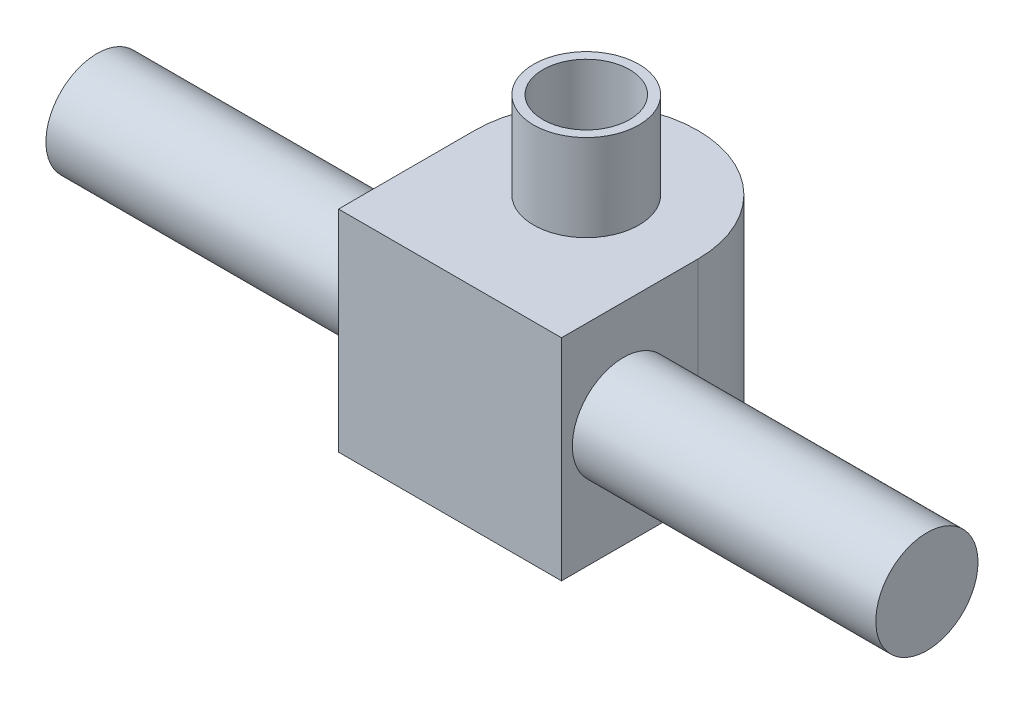
ISO-10303-21;
HEADER;
FILE_DESCRIPTION(('STEP AP214'),'2;1');
FILE_NAME('part.step','',(''),(''),'','','');
FILE_SCHEMA(('AUTOMOTIVE_DESIGN { 1 0 10303 214 1 1 1 1 }'));
ENDSEC;
DATA;
#1=APPLICATION_CONTEXT('core data for automotive mechanical design processes');
#2=APPLICATION_PROTOCOL_DEFINITION('international standard','automotive_design',2000,#1);
#3=PRODUCT_CONTEXT('',#1,'mechanical');
#4=PRODUCT('Part','Part','',(#3));
#5=PRODUCT_RELATED_PRODUCT_CATEGORY('part','',(#4));
#6=PRODUCT_DEFINITION_FORMATION('','',#4);
#7=PRODUCT_DEFINITION_CONTEXT('part definition',#1,'design');
#8=PRODUCT_DEFINITION('design','',#6,#7);
#9=PRODUCT_DEFINITION_SHAPE('','',#8);
#10=(LENGTH_UNIT() NAMED_UNIT(*) SI_UNIT(.MILLI.,.METRE.));
#11=(NAMED_UNIT(*) PLANE_ANGLE_UNIT() SI_UNIT($,.RADIAN.));
#12=(NAMED_UNIT(*) SI_UNIT($,.STERADIAN.) SOLID_ANGLE_UNIT());
#13=UNCERTAINTY_MEASURE_WITH_UNIT(LENGTH_MEASURE(1.E-05),#10,'distance_accuracy_value','');
#14=(GEOMETRIC_REPRESENTATION_CONTEXT(3) GLOBAL_UNCERTAINTY_ASSIGNED_CONTEXT((#13)) GLOBAL_UNIT_ASSIGNED_CONTEXT((#10,
#11,#12)) REPRESENTATION_CONTEXT('',''));
#15=CARTESIAN_POINT('',(0.,0.,0.));
#16=DIRECTION('',(0.,0.,1.));
#17=DIRECTION('',(1.,0.,0.));
#18=AXIS2_PLACEMENT_3D('',#15,#16,#17);
#19=CARTESIAN_POINT('',(0.,48.,0.));
#20=DIRECTION('',(0.,1.,0.));
#21=DIRECTION('',(0.,0.,1.));
#22=AXIS2_PLACEMENT_3D('',#19,#20,#21);
#23=PLANE('',#22);
#24=CARTESIAN_POINT('',(0.,48.,0.));
#25=DIRECTION('',(0.,1.,0.));
#26=DIRECTION('',(0.,0.,1.));
#27=AXIS2_PLACEMENT_3D('',#24,#25,#26);
#28=CIRCLE('',#27,8.5);
#29=CARTESIAN_POINT('',(0.,48.,8.5));
#30=VERTEX_POINT('',#29);
#31=EDGE_CURVE('E117',#30,#30,#28,.T.);
#32=ORIENTED_EDGE('',*,*,#31,.T.);
#33=EDGE_LOOP('',(#32));
#34=FACE_BOUND('',#33,.T.);
#35=CARTESIAN_POINT('',(0.,48.,0.));
#36=DIRECTION('',(0.,1.,0.));
#37=DIRECTION('',(0.,0.,1.));
#38=AXIS2_PLACEMENT_3D('',#35,#36,#37);
#39=CIRCLE('',#38,7.);
#40=CARTESIAN_POINT('',(0.,48.,7.));
#41=VERTEX_POINT('',#40);
#42=EDGE_CURVE('E123',#41,#41,#39,.T.);
#43=ORIENTED_EDGE('',*,*,#42,.F.);
#44=EDGE_LOOP('',(#43));
#45=FACE_BOUND('',#44,.T.);
#46=ADVANCED_FACE('F39',(#34,#45),#23,.T.);
#47=CARTESIAN_POINT('',(0.,0.,0.));
#48=DIRECTION('',(0.,1.,0.));
#49=DIRECTION('',(0.,0.,1.));
#50=AXIS2_PLACEMENT_3D('',#47,#48,#49);
#51=PLANE('',#50);
#52=CARTESIAN_POINT('',(0.,0.,-15.5));
#53=DIRECTION('',(0.,-1.,0.));
#54=DIRECTION('',(0.,0.,-1.));
#55=AXIS2_PLACEMENT_3D('',#52,#53,#54);
#56=CIRCLE('',#55,1.5);
#57=CARTESIAN_POINT('',(0.,0.,-17.));
#58=VERTEX_POINT('',#57);
#59=EDGE_CURVE('E219',#58,#58,#56,.T.);
#60=ORIENTED_EDGE('',*,*,#59,.F.);
#61=EDGE_LOOP('',(#60));
#62=FACE_BOUND('',#61,.T.);
#63=CARTESIAN_POINT('',(-15.5,0.,0.));
#64=DIRECTION('',(0.,-1.,0.));
#65=DIRECTION('',(0.,0.,-1.));
#66=AXIS2_PLACEMENT_3D('',#63,#64,#65);
#67=CIRCLE('',#66,1.5);
#68=CARTESIAN_POINT('',(-15.5,0.,-1.49999999999995));
#69=VERTEX_POINT('',#68);
#70=EDGE_CURVE('E101',#69,#69,#67,.T.);
#71=ORIENTED_EDGE('',*,*,#70,.F.);
#72=EDGE_LOOP('',(#71));
#73=FACE_BOUND('',#72,.T.);
#74=CARTESIAN_POINT('',(1.06337718965459E-13,0.,15.5));
#75=DIRECTION('',(0.,-1.,0.));
#76=DIRECTION('',(0.,0.,-1.));
#77=AXIS2_PLACEMENT_3D('',#74,#75,#76);
#78=CIRCLE('',#77,1.5);
#79=CARTESIAN_POINT('',(1.06337718965459E-13,0.,14.));
#80=VERTEX_POINT('',#79);
#81=EDGE_CURVE('E102',#80,#80,#78,.T.);
#82=ORIENTED_EDGE('',*,*,#81,.F.);
#83=EDGE_LOOP('',(#82));
#84=FACE_BOUND('',#83,.T.);
#85=CARTESIAN_POINT('',(15.5,0.,-1.58720956241551E-13));
#86=DIRECTION('',(0.,-1.,0.));
#87=DIRECTION('',(0.,0.,-1.));
#88=AXIS2_PLACEMENT_3D('',#85,#86,#87);
#89=CIRCLE('',#88,1.5);
#90=CARTESIAN_POINT('',(15.5,0.,-1.50000000000016));
#91=VERTEX_POINT('',#90);
#92=EDGE_CURVE('E110',#91,#91,#89,.T.);
#93=ORIENTED_EDGE('',*,*,#92,.F.);
#94=EDGE_LOOP('',(#93));
#95=FACE_BOUND('',#94,.T.);
#96=CARTESIAN_POINT('',(0.,0.,0.));
#97=DIRECTION('',(0.,1.,0.));
#98=DIRECTION('',(0.,0.,1.));
#99=AXIS2_PLACEMENT_3D('',#96,#97,#98);
#100=CIRCLE('',#99,7.);
#101=CARTESIAN_POINT('',(0.,0.,7.));
#102=VERTEX_POINT('',#101);
#103=EDGE_CURVE('E232',#102,#102,#100,.T.);
#104=ORIENTED_EDGE('',*,*,#103,.T.);
#105=EDGE_LOOP('',(#104));
#106=FACE_BOUND('',#105,.T.);
#107=DIRECTION('',(0.,0.,1.));
#108=VECTOR('',#107,1.);
#109=CARTESIAN_POINT('',(18.,0.,22.));
#110=LINE('',#109,#108);
#111=CARTESIAN_POINT('',(18.,0.,0.));
#112=VERTEX_POINT('',#111);
#113=CARTESIAN_POINT('',(18.,0.,22.));
#114=VERTEX_POINT('',#113);
#115=EDGE_CURVE('E236',#112,#114,#110,.T.);
#116=ORIENTED_EDGE('',*,*,#115,.T.);
#117=DIRECTION('',(-1.,0.,0.));
#118=VECTOR('',#117,1.);
#119=CARTESIAN_POINT('',(-18.,0.,22.));
#120=LINE('',#119,#118);
#121=CARTESIAN_POINT('',(-18.,0.,22.));
#122=VERTEX_POINT('',#121);
#123=EDGE_CURVE('E238',#114,#122,#120,.T.);
#124=ORIENTED_EDGE('',*,*,#123,.T.);
#125=DIRECTION('',(0.,0.,-1.));
#126=VECTOR('',#125,1.);
#127=CARTESIAN_POINT('',(-18.,0.,22.));
#128=LINE('',#127,#126);
#129=CARTESIAN_POINT('',(-18.,0.,0.));
#130=VERTEX_POINT('',#129);
#131=EDGE_CURVE('E245',#122,#130,#128,.T.);
#132=ORIENTED_EDGE('',*,*,#131,.T.);
#133=CARTESIAN_POINT('',(0.,0.,0.));
#134=DIRECTION('',(0.,-1.,0.));
#135=DIRECTION('',(0.,0.,1.));
#136=AXIS2_PLACEMENT_3D('',#133,#134,#135);
#137=CIRCLE('',#136,18.);
#138=EDGE_CURVE('E239',#130,#112,#137,.T.);
#139=ORIENTED_EDGE('',*,*,#138,.T.);
#140=EDGE_LOOP('',(#116,#124,#132,#139));
#141=FACE_BOUND('',#140,.T.);
#142=ADVANCED_FACE('F208',(#62,#73,#84,#95,#106,#141),#51,.F.);
#143=CARTESIAN_POINT('',(0.,48.,0.));
#144=DIRECTION('',(0.,-1.,0.));
#145=DIRECTION('',(0.,0.,-1.));
#146=AXIS2_PLACEMENT_3D('',#143,#144,#145);
#147=CYLINDRICAL_SURFACE('',#146,8.5);
#148=CARTESIAN_POINT('',(0.,34.,0.));
#149=DIRECTION('',(0.,-1.,0.));
#150=DIRECTION('',(0.,0.,-1.));
#151=AXIS2_PLACEMENT_3D('',#148,#149,#150);
#152=CIRCLE('',#151,8.5);
#153=CARTESIAN_POINT('',(0.,34.,-8.5));
#154=VERTEX_POINT('',#153);
#155=EDGE_CURVE('E241',#154,#154,#152,.T.);
#156=ORIENTED_EDGE('',*,*,#155,.F.);
#157=EDGE_LOOP('',(#156));
#158=FACE_BOUND('',#157,.T.);
#159=ORIENTED_EDGE('',*,*,#31,.F.);
#160=EDGE_LOOP('',(#159));
#161=FACE_BOUND('',#160,.T.);
#162=ADVANCED_FACE('F41',(#158,#161),#147,.T.);
#163=CARTESIAN_POINT('',(0.,48.,0.));
#164=DIRECTION('',(0.,-1.,0.));
#165=DIRECTION('',(0.,0.,-1.));
#166=AXIS2_PLACEMENT_3D('',#163,#164,#165);
#167=CYLINDRICAL_SURFACE('',#166,7.);
#168=CARTESIAN_POINT('',(-5.91079520876845,18.,3.75));
#169=CARTESIAN_POINT('',(-5.91079563488197,18.187304241795,3.75000051813684));
#170=CARTESIAN_POINT('',(-5.90675866768192,18.3746173514055,3.75638559280068));
#171=CARTESIAN_POINT('',(-5.89048637754292,18.74803222059,3.78185089477246));
#172=CARTESIAN_POINT('',(-5.87825045880732,18.9341338911395,3.80093204467072));
#173=CARTESIAN_POINT('',(-5.8452027285503,19.3039471786942,3.85156071027383));
#174=CARTESIAN_POINT('',(-5.82438749352158,19.4876578113518,3.88311320236123));
#175=CARTESIAN_POINT('',(-5.77358171078199,19.8513138674386,3.95825851029823));
#176=CARTESIAN_POINT('',(-5.74359135545138,20.0312593697292,4.00185107369454));
#177=CARTESIAN_POINT('',(-5.67350015383295,20.3867201620871,4.10061901367612));
#178=CARTESIAN_POINT('',(-5.63336055410712,20.5622155679854,4.15583864824612));
#179=CARTESIAN_POINT('',(-5.5420683038906,20.9066042536448,4.27682343679693));
#180=CARTESIAN_POINT('',(-5.4909154571988,21.0754974157236,4.3425887786443));
#181=CARTESIAN_POINT('',(-5.37660796239477,21.4050440783591,4.48333523736493));
#182=CARTESIAN_POINT('',(-5.31346238738572,21.5657036920745,4.55830937227038));
#183=CARTESIAN_POINT('',(-5.17415267958154,21.8773773970607,4.71584450931568));
#184=CARTESIAN_POINT('',(-5.09798998563015,22.0283925518477,4.79840467247008));
#185=CARTESIAN_POINT('',(-4.93765424721169,22.3091038319219,4.96304582383478));
#186=CARTESIAN_POINT('',(-4.85441681602166,22.4395523297969,5.04475480555067));
#187=CARTESIAN_POINT('',(-4.67555851312456,22.6897668734619,5.21095434747425));
#188=CARTESIAN_POINT('',(-4.5799381698244,22.8095333747088,5.2954447888761));
#189=CARTESIAN_POINT('',(-4.37629525812332,23.0374251160257,5.464940092843));
#190=CARTESIAN_POINT('',(-4.26828149881286,23.1455585201254,5.54994454983769));
#191=CARTESIAN_POINT('',(-4.04008843311643,23.3496666932256,5.71819589503446));
#192=CARTESIAN_POINT('',(-3.91991045907789,23.4456427912299,5.80144297451771));
#193=CARTESIAN_POINT('',(-3.68332745734186,23.6142723092334,5.95402807963966));
#194=CARTESIAN_POINT('',(-3.56822700287841,23.6883425928464,6.02382989223594));
#195=CARTESIAN_POINT('',(-3.32983276729271,23.82686713385,6.15881232562498));
#196=CARTESIAN_POINT('',(-3.20653970967044,23.8913222387429,6.22399335343759));
#197=CARTESIAN_POINT('',(-2.95257737916772,24.0107779955732,6.3484080355806));
#198=CARTESIAN_POINT('',(-2.8219072691763,24.0657775716683,6.40764101282832));
#199=CARTESIAN_POINT('',(-2.55414994762294,24.1665847215861,6.5189984886717));
#200=CARTESIAN_POINT('',(-2.41706264457166,24.2123921643082,6.57112288587948));
#201=CARTESIAN_POINT('',(-2.14144879528854,24.293978824662,6.66594592410815));
#202=CARTESIAN_POINT('',(-2.00307234035331,24.3300048054877,6.70886926428114));
#203=CARTESIAN_POINT('',(-1.72213353315549,24.394029903439,6.78642032891776));
#204=CARTESIAN_POINT('',(-1.57956938577666,24.4220255211994,6.82104443577439));
#205=CARTESIAN_POINT('',(-1.29127892047717,24.4702700918449,6.88144548417814));
#206=CARTESIAN_POINT('',(-1.14555229655446,24.4905182915242,6.9072215654932));
#207=CARTESIAN_POINT('',(-0.851988454071188,24.5235013275294,6.9495396344341));
#208=CARTESIAN_POINT('',(-0.704152113798625,24.5362392020817,6.96608535596301));
#209=CARTESIAN_POINT('',(-0.402349898397727,24.5546811822705,6.99012034612255));
#210=CARTESIAN_POINT('',(-0.248343404519432,24.560137874846,6.99729089423867));
#211=CARTESIAN_POINT('',(0.0598878014283026,24.563300280505,7.00144063707226));
#212=CARTESIAN_POINT('',(0.214112517798186,24.5610058386515,6.99841962807117));
#213=CARTESIAN_POINT('',(0.521737807903895,24.5486314429923,6.98222857932603));
#214=CARTESIAN_POINT('',(0.675138262200292,24.5385503899572,6.96905710665003));
#215=CARTESIAN_POINT('',(0.980024567834415,24.5104588468833,6.93275701978961));
#216=CARTESIAN_POINT('',(1.1315104161297,24.4924483442459,6.90962838978465));
#217=CARTESIAN_POINT('',(1.43353652639617,24.4479576003279,6.85338503128129));
#218=CARTESIAN_POINT('',(1.58403585857403,24.4213654215213,6.8201386755534));
#219=CARTESIAN_POINT('',(1.88083992621728,24.3594620794944,6.74432356207163));
#220=CARTESIAN_POINT('',(2.02714461907696,24.3241508277479,6.70175470966539));
#221=CARTESIAN_POINT('',(2.31439376094317,24.2444544879908,6.60805537530463));
#222=CARTESIAN_POINT('',(2.45533990904453,24.2000723051482,6.55692763547103));
#223=CARTESIAN_POINT('',(2.73082951730922,24.1018654166801,6.44705816432608));
#224=CARTESIAN_POINT('',(2.86537319452735,24.0480410314519,6.38831669138518));
#225=CARTESIAN_POINT('',(3.12370769161892,23.9321405772655,6.26596809970385));
#226=CARTESIAN_POINT('',(3.24768498672978,23.8703092613075,6.20252277678792));
#227=CARTESIAN_POINT('',(3.48774587525778,23.7372133789132,6.07078040954612));
#228=CARTESIAN_POINT('',(3.60382964771699,23.6659490265465,6.00248347533713));
#229=CARTESIAN_POINT('',(3.82737722971734,23.5139745066301,5.86247182775932));
#230=CARTESIAN_POINT('',(3.93484336244511,23.4332668993663,5.79075804388921));
#231=CARTESIAN_POINT('',(4.14068142516731,23.262530523144,5.64540824583206));
#232=CARTESIAN_POINT('',(4.23905343744766,23.1725018385405,5.57177224904543));
#233=CARTESIAN_POINT('',(4.42425599742463,22.9856205068359,5.42582189247847));
#234=CARTESIAN_POINT('',(4.51129984121627,22.8889722504598,5.35351605354509));
#235=CARTESIAN_POINT('',(4.6763605545248,22.6875437670072,5.20995385241699));
#236=CARTESIAN_POINT('',(4.75437759199684,22.5827636912941,5.13869747071732));
#237=CARTESIAN_POINT('',(4.90152566909309,22.365629732802,4.99853746859178));
#238=CARTESIAN_POINT('',(4.97065477572345,22.2532742105474,4.92963436235337));
#239=CARTESIAN_POINT('',(5.10029823611798,22.0216751337373,4.79538005618516));
#240=CARTESIAN_POINT('',(5.16081168103017,21.9024308543605,4.73002923142854));
#241=CARTESIAN_POINT('',(5.27674763153245,21.6510112486937,4.60042509778454));
#242=CARTESIAN_POINT('',(5.33170221461585,21.5184855259897,4.53643327583041));
#243=CARTESIAN_POINT('',(5.43302025221713,21.2474723603688,4.41458623111611));
#244=CARTESIAN_POINT('',(5.47938345343566,21.1089847418258,4.35673118930786));
#245=CARTESIAN_POINT('',(5.56413348740538,20.8268814953529,4.24796134322401));
#246=CARTESIAN_POINT('',(5.60251739813908,20.6832640113466,4.19704908373606));
#247=CARTESIAN_POINT('',(5.67187569789847,20.3918055374465,4.10283406714864));
#248=CARTESIAN_POINT('',(5.70284954573318,20.2439642399503,4.05953186590799));
#249=CARTESIAN_POINT('',(5.76130191100901,19.9265344695208,3.97621748748948));
#250=CARTESIAN_POINT('',(5.78788542943491,19.7565031521045,3.93726067478395));
#251=CARTESIAN_POINT('',(5.83302429256245,19.4132844417907,3.87007287985197));
#252=CARTESIAN_POINT('',(5.85157907130802,19.2400968272981,3.84184265377337));
#253=CARTESIAN_POINT('',(5.88114215052345,18.8915625379158,3.79643285396927));
#254=CARTESIAN_POINT('',(5.89214701602502,18.7162149171746,3.77925831044359));
#255=CARTESIAN_POINT('',(5.90689167743727,18.3644757798213,3.75617040398112));
#256=CARTESIAN_POINT('',(5.91063121588915,18.1880842264379,3.75025744011706));
#257=CARTESIAN_POINT('',(5.91096331785657,17.8190438080911,3.74973616815261));
#258=CARTESIAN_POINT('',(5.90686708402811,17.6263914719954,3.75621734130279));
#259=CARTESIAN_POINT('',(5.89000258976084,17.2423783866867,3.78260656560284));
#260=CARTESIAN_POINT('',(5.87723373716736,17.0510177265687,3.80251553358369));
#261=CARTESIAN_POINT('',(5.84260880145647,16.6708836069768,3.85550580814643));
#262=CARTESIAN_POINT('',(5.82074951636049,16.4821110833637,3.8885917559625));
#263=CARTESIAN_POINT('',(5.76727979816761,16.1086380564339,3.96746174473059));
#264=CARTESIAN_POINT('',(5.73566958876695,15.9239374598071,4.01324549437955));
#265=CARTESIAN_POINT('',(5.66172532774023,15.5596525756648,4.11690758745482));
#266=CARTESIAN_POINT('',(5.61936590881117,15.3800815245725,4.17481448319854));
#267=CARTESIAN_POINT('',(5.52290658721888,15.0280862354015,4.30160950483669));
#268=CARTESIAN_POINT('',(5.46880641364574,14.8556621623436,4.37049788411163));
#269=CARTESIAN_POINT('',(5.34780473031314,14.5197697760579,4.51774847720995));
#270=CARTESIAN_POINT('',(5.28091563142515,14.356292976275,4.59610147927091));
#271=CARTESIAN_POINT('',(5.13324894907468,14.0397867155163,4.7604564406927));
#272=CARTESIAN_POINT('',(5.05247349728549,13.8867556560602,4.8464572250772));
#273=CARTESIAN_POINT('',(4.88490521713058,13.6072259186936,5.01501620849972));
#274=CARTESIAN_POINT('',(4.79949246024364,13.4795991533362,5.09707684938821));
#275=CARTESIAN_POINT('',(4.61635984777139,13.2351241447334,5.26350833287684));
#276=CARTESIAN_POINT('',(4.51864078508007,13.1182752079132,5.3478790263667));
#277=CARTESIAN_POINT('',(4.31095156832821,12.8962466069547,5.5166641711195));
#278=CARTESIAN_POINT('',(4.20098988636789,12.7910589723661,5.60107855237824));
#279=CARTESIAN_POINT('',(3.96912459836252,12.5928042635721,5.76770455384419));
#280=CARTESIAN_POINT('',(3.84722218339364,12.4997359826262,5.84991639271309));
#281=CARTESIAN_POINT('',(3.60759792768787,12.3364263737223,6.00023058950577));
#282=CARTESIAN_POINT('',(3.49114294153476,12.2647857638448,6.06883927659271));
#283=CARTESIAN_POINT('',(3.25027937612684,12.1310162532112,6.2011739726316));
#284=CARTESIAN_POINT('',(3.12587151290406,12.0688864978565,6.26490042002017));
#285=CARTESIAN_POINT('',(2.86993481553657,11.9539499564487,6.38619860230097));
#286=CARTESIAN_POINT('',(2.7384050908963,11.9011443397908,6.44376956484086));
#287=CARTESIAN_POINT('',(2.46919070599732,11.8045796223857,6.55165062906614));
#288=CARTESIAN_POINT('',(2.33150593418089,11.7608206856868,6.60196059907905));
#289=CARTESIAN_POINT('',(2.05422067693194,11.6829166961995,6.69335486907505));
#290=CARTESIAN_POINT('',(1.91473645028458,11.6485742613284,6.73462421007511));
#291=CARTESIAN_POINT('',(1.63177930241357,11.5878685894747,6.80872197985952));
#292=CARTESIAN_POINT('',(1.48830466607689,11.5615088432479,6.84154671495443));
#293=CARTESIAN_POINT('',(1.19839373100041,11.5164960238088,6.89823682507135));
#294=CARTESIAN_POINT('',(1.05195713051904,11.497843739962,6.92210128239698));
#295=CARTESIAN_POINT('',(0.757177324137501,11.4680262536804,6.96051491654962));
#296=CARTESIAN_POINT('',(0.608834916789838,11.4568580133378,6.97506787297362));
#297=CARTESIAN_POINT('',(0.306137686089737,11.4415962552892,6.99500192850819));
#298=CARTESIAN_POINT('',(0.15174864771388,11.4377537065752,7.00005758065578));
#299=CARTESIAN_POINT('',(-0.157025166392745,11.4378423026427,6.99994142500147));
#300=CARTESIAN_POINT('',(-0.31140994196895,11.4417736084661,6.99476940532475));
#301=CARTESIAN_POINT('',(-0.619125154989479,11.4574683949019,6.97427152218687));
#302=CARTESIAN_POINT('',(-0.772455454410359,11.4692328818247,6.95894435411871));
#303=CARTESIAN_POINT('',(-1.07696637940208,11.5007602636497,6.91836226066161));
#304=CARTESIAN_POINT('',(-1.22814700591039,11.5205231550635,6.8931073396023));
#305=CARTESIAN_POINT('',(-1.52900563359266,11.5685818792265,6.83271184790996));
#306=CARTESIAN_POINT('',(-1.67864615481532,11.596973561085,6.7974605476541));
#307=CARTESIAN_POINT('',(-1.97349931338563,11.6625436465125,6.71778393696726));
#308=CARTESIAN_POINT('',(-2.11871191305375,11.6997221248296,6.67335854849405));
#309=CARTESIAN_POINT('',(-2.40354632855998,11.7832217885053,6.57613881554201));
#310=CARTESIAN_POINT('',(-2.54317003631847,11.8295398479571,6.52334733363501));
#311=CARTESIAN_POINT('',(-2.81579914401404,11.9316802007738,6.4103856667183));
#312=CARTESIAN_POINT('',(-2.94880477429349,11.9875021630558,6.35021573876851));
#313=CARTESIAN_POINT('',(-3.20371462508385,12.1072963934793,6.22541624991903));
#314=CARTESIAN_POINT('',(-3.32582142953356,12.1710084579751,6.16095058409666));
#315=CARTESIAN_POINT('',(-3.5620113291337,12.307847926828,6.02747670940504));
#316=CARTESIAN_POINT('',(-3.67609461466599,12.3809751076668,5.95846860839383));
#317=CARTESIAN_POINT('',(-3.89555511717298,12.5366237992019,5.81735919001744));
#318=CARTESIAN_POINT('',(-4.00093447985175,12.6191429825676,5.74525864170581));
#319=CARTESIAN_POINT('',(-4.20255616066695,12.7934132475932,5.59946441848999));
#320=CARTESIAN_POINT('',(-4.29879853264824,12.8851642748428,5.52577075297728));
#321=CARTESIAN_POINT('',(-4.4800178194528,13.0755614295078,5.37984197989983));
#322=CARTESIAN_POINT('',(-4.56518566555099,13.1740270144604,5.30760803493166));
#323=CARTESIAN_POINT('',(-4.72649688809291,13.3789836465548,5.16448035869758));
#324=CARTESIAN_POINT('',(-4.80264041381069,13.4854745608995,5.09358660527945));
#325=CARTESIAN_POINT('',(-4.9460837365393,13.7059047764218,4.95441704933315));
#326=CARTESIAN_POINT('',(-5.01338125721874,13.8198459835226,4.88614192384181));
#327=CARTESIAN_POINT('',(-5.13943022016165,14.0544710702716,4.75338187726131));
#328=CARTESIAN_POINT('',(-5.19818074479694,14.1751556719861,4.68889736358455));
#329=CARTESIAN_POINT('',(-5.31086226965353,14.4300050746656,4.56096968544203));
#330=CARTESIAN_POINT('',(-5.36428681320643,14.5645437074883,4.49782542884873));
#331=CARTESIAN_POINT('',(-5.46257813599131,14.8394605681724,4.37792779966246));
#332=CARTESIAN_POINT('',(-5.50744458055478,14.9798390241415,4.32117467703335));
#333=CARTESIAN_POINT('',(-5.58923961666488,15.2655754631365,4.21484311982821));
#334=CARTESIAN_POINT('',(-5.62616612914054,15.4109347388661,4.16526656554417));
#335=CARTESIAN_POINT('',(-5.6926558482299,15.7057363731062,4.07392447767653));
#336=CARTESIAN_POINT('',(-5.72221852685529,15.8551790235433,4.03215950423826));
#337=CARTESIAN_POINT('',(-5.77627139706093,16.1675046517043,3.95437538565903));
#338=CARTESIAN_POINT('',(-5.80028480017116,16.3306141757388,3.91893399958377));
#339=CARTESIAN_POINT('',(-5.84105392035773,16.6595579590803,3.85790551232702));
#340=CARTESIAN_POINT('',(-5.85780942125857,16.8253922993928,3.83231870466516));
#341=CARTESIAN_POINT('',(-5.8844623904218,17.1589089794311,3.79126658787359));
#342=CARTESIAN_POINT('',(-5.8943576123974,17.3265919062061,3.77580459404142));
#343=CARTESIAN_POINT('',(-5.9075239189949,17.6628474782829,3.75517092839395));
#344=CARTESIAN_POINT('',(-5.91079482525254,17.831420147419,3.74999953366015));
#345=CARTESIAN_POINT('',(-5.91079520876845,18.,3.75));
#346=B_SPLINE_CURVE_WITH_KNOTS('',3,(#168,#169,#170,#171,#172,#173,#174,#175,#176,#177,#178,
#179,#180,#181,#182,#183,#184,#185,#186,#187,#188,#189,#190,#191,#192,#193,#194,#195,#196,#197,
#198,#199,#200,#201,#202,#203,#204,#205,#206,#207,#208,#209,#210,#211,#212,#213,#214,#215,#216,
#217,#218,#219,#220,#221,#222,#223,#224,#225,#226,#227,#228,#229,#230,#231,#232,#233,#234,#235,
#236,#237,#238,#239,#240,#241,#242,#243,#244,#245,#246,#247,#248,#249,#250,#251,#252,#253,#254,
#255,#256,#257,#258,#259,#260,#261,#262,#263,#264,#265,#266,#267,#268,#269,#270,#271,#272,#273,
#274,#275,#276,#277,#278,#279,#280,#281,#282,#283,#284,#285,#286,#287,#288,#289,#290,#291,#292,
#293,#294,#295,#296,#297,#298,#299,#300,#301,#302,#303,#304,#305,#306,#307,#308,#309,#310,#311,
#312,#313,#314,#315,#316,#317,#318,#319,#320,#321,#322,#323,#324,#325,#326,#327,#328,#329,#330,
#331,#332,#333,#334,#335,#336,#337,#338,#339,#340,#341,#342,#343,#344,#345),.UNSPECIFIED.,.T.,
.F.,(4,2,2,2,2,2,2,2,2,2,2,2,2,2,2,2,2,2,2,2,2,2,2,2,2,2,2,2,2,2,2,2,2,2,2,2,2,2,2,2,2,2,2,2,2,
2,2,2,2,2,2,2,2,2,2,2,2,2,2,2,2,2,2,2,2,2,2,2,2,2,2,2,2,2,2,2,2,2,2,2,2,2,2,2,2,2,2,2,4),(0.,
0.561775360546926,1.12359154828802,1.68563214165262,2.2476609511811,2.81186907945147,
3.37608725992765,3.93988026915975,4.50361099993932,5.02782953180445,5.55202570144351,
6.07585156034388,6.59962010651413,7.05998009531694,7.52029948299255,7.98067121081068,
8.44104950410814,8.88842068509335,9.3359865204302,9.78359585716787,10.2310239935957,
10.6932983251022,11.155581897044,11.6179307411051,12.0802803197779,12.5489225055546,
13.017569449729,13.4860665338047,13.9545477236897,14.4111109495311,14.8676638160805,
15.3240931861178,15.7805184258619,16.2264536111277,16.6723804978699,17.1184042036668,
17.5644749249652,18.0352639774414,18.5060669079635,18.9770419440598,19.4480513671353,
19.976845229296,20.5056763607388,21.034747934104,21.5638382556479,22.141579508684,
22.7193602130757,23.297344605304,23.8753157389617,24.4546637345914,25.034025099703,
25.612827057761,26.1915402440047,26.7131537557814,27.2347336772314,27.7559548740466,
28.2771241324118,28.7354809089716,29.1937964756466,29.6521694816166,30.1105507987814,
30.558424835955,31.0064944424305,31.4546099269217,31.9025434029238,32.3655646361653,
32.8285954613808,33.291685782567,33.7547759017931,34.223210701503,34.691649486263,
35.1599283330667,35.6281908699952,36.0838333424773,36.5394649998368,36.9949839968527,
37.4505003093001,37.8966514285565,38.3427951668599,38.7890534869529,39.2353596832207,
39.7086611867149,40.181981195096,40.6554249917803,41.128902724712,41.6343245642599,
42.1397614566853,42.6453637681397,43.1509796931024),.UNSPECIFIED.);
#347=CARTESIAN_POINT('',(-5.91079520876845,18.,3.75));
#348=VERTEX_POINT('',#347);
#349=EDGE_CURVE('E11',#348,#348,#346,.T.);
#350=ORIENTED_EDGE('',*,*,#349,.F.);
#351=EDGE_LOOP('',(#350));
#352=FACE_BOUND('',#351,.T.);
#353=ORIENTED_EDGE('',*,*,#42,.T.);
#354=EDGE_LOOP('',(#353));
#355=FACE_BOUND('',#354,.T.);
#356=ORIENTED_EDGE('',*,*,#103,.F.);
#357=EDGE_LOOP('',(#356));
#358=FACE_BOUND('',#357,.T.);
#359=ADVANCED_FACE('F201',(#352,#355,#358),#167,.F.);
#360=CARTESIAN_POINT('',(18.,34.,22.));
#361=DIRECTION('',(1.,0.,0.));
#362=DIRECTION('',(0.,0.,-1.));
#363=AXIS2_PLACEMENT_3D('',#360,#361,#362);
#364=PLANE('',#363);
#365=CARTESIAN_POINT('',(18.,18.,12.));
#366=DIRECTION('',(1.,0.,0.));
#367=DIRECTION('',(0.,0.,-1.));
#368=AXIS2_PLACEMENT_3D('',#365,#366,#367);
#369=CIRCLE('',#368,8.25);
#370=CARTESIAN_POINT('',(18.,18.,3.75));
#371=VERTEX_POINT('',#370);
#372=EDGE_CURVE('E50',#371,#371,#369,.T.);
#373=ORIENTED_EDGE('',*,*,#372,.F.);
#374=EDGE_LOOP('',(#373));
#375=FACE_BOUND('',#374,.T.);
#376=ORIENTED_EDGE('',*,*,#115,.F.);
#377=DIRECTION('',(0.,-1.,0.));
#378=VECTOR('',#377,1.);
#379=CARTESIAN_POINT('',(18.,34.,0.));
#380=LINE('',#379,#378);
#381=CARTESIAN_POINT('',(18.,34.,0.));
#382=VERTEX_POINT('',#381);
#383=EDGE_CURVE('E66',#382,#112,#380,.T.);
#384=ORIENTED_EDGE('',*,*,#383,.F.);
#385=DIRECTION('',(0.,0.,1.));
#386=VECTOR('',#385,1.);
#387=CARTESIAN_POINT('',(18.,34.,22.));
#388=LINE('',#387,#386);
#389=CARTESIAN_POINT('',(18.,34.,22.));
#390=VERTEX_POINT('',#389);
#391=EDGE_CURVE('E257',#382,#390,#388,.T.);
#392=ORIENTED_EDGE('',*,*,#391,.T.);
#393=DIRECTION('',(0.,-1.,0.));
#394=VECTOR('',#393,1.);
#395=CARTESIAN_POINT('',(18.,34.,22.));
#396=LINE('',#395,#394);
#397=EDGE_CURVE('E92',#390,#114,#396,.T.);
#398=ORIENTED_EDGE('',*,*,#397,.T.);
#399=EDGE_LOOP('',(#376,#384,#392,#398));
#400=FACE_BOUND('',#399,.T.);
#401=ADVANCED_FACE('F194',(#375,#400),#364,.T.);
#402=CARTESIAN_POINT('',(0.,34.,0.));
#403=DIRECTION('',(0.,-1.,0.));
#404=DIRECTION('',(0.,0.,-1.));
#405=AXIS2_PLACEMENT_3D('',#402,#403,#404);
#406=CYLINDRICAL_SURFACE('',#405,18.);
#407=ORIENTED_EDGE('',*,*,#138,.F.);
#408=DIRECTION('',(0.,-1.,0.));
#409=VECTOR('',#408,1.);
#410=CARTESIAN_POINT('',(-18.,34.,0.));
#411=LINE('',#410,#409);
#412=CARTESIAN_POINT('',(-18.,34.,0.));
#413=VERTEX_POINT('',#412);
#414=EDGE_CURVE('E260',#413,#130,#411,.T.);
#415=ORIENTED_EDGE('',*,*,#414,.F.);
#416=CARTESIAN_POINT('',(0.,34.,0.));
#417=DIRECTION('',(0.,-1.,0.));
#418=DIRECTION('',(0.,0.,1.));
#419=AXIS2_PLACEMENT_3D('',#416,#417,#418);
#420=CIRCLE('',#419,18.);
#421=EDGE_CURVE('E250',#413,#382,#420,.T.);
#422=ORIENTED_EDGE('',*,*,#421,.T.);
#423=ORIENTED_EDGE('',*,*,#383,.T.);
#424=EDGE_LOOP('',(#407,#415,#422,#423));
#425=FACE_BOUND('',#424,.T.);
#426=ADVANCED_FACE('F190',(#425),#406,.T.);
#427=CARTESIAN_POINT('',(-18.,34.,22.));
#428=DIRECTION('',(-1.,0.,0.));
#429=DIRECTION('',(0.,0.,1.));
#430=AXIS2_PLACEMENT_3D('',#427,#428,#429);
#431=PLANE('',#430);
#432=CARTESIAN_POINT('',(-18.,18.,12.));
#433=DIRECTION('',(-1.,0.,0.));
#434=DIRECTION('',(0.,0.,1.));
#435=AXIS2_PLACEMENT_3D('',#432,#433,#434);
#436=CIRCLE('',#435,8.25);
#437=CARTESIAN_POINT('',(-18.,18.,20.25));
#438=VERTEX_POINT('',#437);
#439=EDGE_CURVE('E116',#438,#438,#436,.T.);
#440=ORIENTED_EDGE('',*,*,#439,.F.);
#441=EDGE_LOOP('',(#440));
#442=FACE_BOUND('',#441,.T.);
#443=ORIENTED_EDGE('',*,*,#131,.F.);
#444=DIRECTION('',(0.,-1.,0.));
#445=VECTOR('',#444,1.);
#446=CARTESIAN_POINT('',(-18.,34.,22.));
#447=LINE('',#446,#445);
#448=CARTESIAN_POINT('',(-18.,34.,22.));
#449=VERTEX_POINT('',#448);
#450=EDGE_CURVE('E263',#449,#122,#447,.T.);
#451=ORIENTED_EDGE('',*,*,#450,.F.);
#452=DIRECTION('',(0.,0.,-1.));
#453=VECTOR('',#452,1.);
#454=CARTESIAN_POINT('',(-18.,34.,22.));
#455=LINE('',#454,#453);
#456=EDGE_CURVE('E274',#449,#413,#455,.T.);
#457=ORIENTED_EDGE('',*,*,#456,.T.);
#458=ORIENTED_EDGE('',*,*,#414,.T.);
#459=EDGE_LOOP('',(#443,#451,#457,#458));
#460=FACE_BOUND('',#459,.T.);
#461=ADVANCED_FACE('F193',(#442,#460),#431,.T.);
#462=CARTESIAN_POINT('',(-18.,34.,22.));
#463=DIRECTION('',(0.,0.,1.));
#464=DIRECTION('',(1.,0.,0.));
#465=AXIS2_PLACEMENT_3D('',#462,#463,#464);
#466=PLANE('',#465);
#467=ORIENTED_EDGE('',*,*,#123,.F.);
#468=ORIENTED_EDGE('',*,*,#397,.F.);
#469=DIRECTION('',(-1.,0.,0.));
#470=VECTOR('',#469,1.);
#471=CARTESIAN_POINT('',(-18.,34.,22.));
#472=LINE('',#471,#470);
#473=EDGE_CURVE('E277',#390,#449,#472,.T.);
#474=ORIENTED_EDGE('',*,*,#473,.T.);
#475=ORIENTED_EDGE('',*,*,#450,.T.);
#476=EDGE_LOOP('',(#467,#468,#474,#475));
#477=FACE_BOUND('',#476,.T.);
#478=ADVANCED_FACE('F188',(#477),#466,.T.);
#479=CARTESIAN_POINT('',(0.,34.,0.));
#480=DIRECTION('',(0.,1.,0.));
#481=DIRECTION('',(0.,0.,1.));
#482=AXIS2_PLACEMENT_3D('',#479,#480,#481);
#483=PLANE('',#482);
#484=ORIENTED_EDGE('',*,*,#155,.T.);
#485=EDGE_LOOP('',(#484));
#486=FACE_BOUND('',#485,.T.);
#487=ORIENTED_EDGE('',*,*,#391,.F.);
#488=ORIENTED_EDGE('',*,*,#421,.F.);
#489=ORIENTED_EDGE('',*,*,#456,.F.);
#490=ORIENTED_EDGE('',*,*,#473,.F.);
#491=EDGE_LOOP('',(#487,#488,#489,#490));
#492=FACE_BOUND('',#491,.T.);
#493=ADVANCED_FACE('F184',(#486,#492),#483,.T.);
#494=CARTESIAN_POINT('',(15.5,10.,-1.58720956241551E-13));
#495=DIRECTION('',(0.,-1.,0.));
#496=DIRECTION('',(0.,0.,-1.));
#497=AXIS2_PLACEMENT_3D('',#494,#495,#496);
#498=CYLINDRICAL_SURFACE('',#497,1.5);
#499=CARTESIAN_POINT('',(15.5,10.,-1.58720956241551E-13));
#500=DIRECTION('',(0.,-1.,0.));
#501=DIRECTION('',(0.,0.,-1.));
#502=AXIS2_PLACEMENT_3D('',#499,#500,#501);
#503=CIRCLE('',#502,1.5);
#504=CARTESIAN_POINT('',(15.5,10.,-1.50000000000016));
#505=VERTEX_POINT('',#504);
#506=EDGE_CURVE('E284',#505,#505,#503,.T.);
#507=ORIENTED_EDGE('',*,*,#506,.F.);
#508=EDGE_LOOP('',(#507));
#509=FACE_BOUND('',#508,.T.);
#510=ORIENTED_EDGE('',*,*,#92,.T.);
#511=EDGE_LOOP('',(#510));
#512=FACE_BOUND('',#511,.T.);
#513=ADVANCED_FACE('F180',(#509,#512),#498,.F.);
#514=CARTESIAN_POINT('',(15.5,10.,-1.58720956241551E-13));
#515=DIRECTION('',(0.,-1.,0.));
#516=DIRECTION('',(0.,0.,-1.));
#517=AXIS2_PLACEMENT_3D('',#514,#515,#516);
#518=PLANE('',#517);
#519=ORIENTED_EDGE('',*,*,#506,.T.);
#520=EDGE_LOOP('',(#519));
#521=FACE_BOUND('',#520,.T.);
#522=ADVANCED_FACE('F177',(#521),#518,.T.);
#523=CARTESIAN_POINT('',(1.06337718965459E-13,10.,15.5));
#524=DIRECTION('',(0.,-1.,0.));
#525=DIRECTION('',(0.,0.,-1.));
#526=AXIS2_PLACEMENT_3D('',#523,#524,#525);
#527=CYLINDRICAL_SURFACE('',#526,1.5);
#528=CARTESIAN_POINT('',(1.06337718965459E-13,10.,15.5));
#529=DIRECTION('',(0.,-1.,0.));
#530=DIRECTION('',(0.,0.,-1.));
#531=AXIS2_PLACEMENT_3D('',#528,#529,#530);
#532=CIRCLE('',#531,1.5);
#533=CARTESIAN_POINT('',(0.215525078639425,10.,14.0155644370746));
#534=VERTEX_POINT('',#533);
#535=CARTESIAN_POINT('',(-0.215525078639213,10.,14.0155644370746));
#536=VERTEX_POINT('',#535);
#537=EDGE_CURVE('E43',#534,#536,#532,.T.);
#538=ORIENTED_EDGE('',*,*,#537,.F.);
#539=CARTESIAN_POINT('',(0.215525078639425,10.,14.0155644370746));
#540=CARTESIAN_POINT('',(0.197723765687022,9.99934881857669,14.012979674744));
#541=CARTESIAN_POINT('',(0.179872982307743,9.99877936876938,14.0107150655164));
#542=CARTESIAN_POINT('',(0.144080227586324,9.99780303617159,14.0068271698538));
#543=CARTESIAN_POINT('',(0.126138186099072,9.99739630726971,14.0052044905216));
#544=CARTESIAN_POINT('',(0.0901859425762952,9.99674541425215,14.002605028948));
#545=CARTESIAN_POINT('',(0.0721756895381754,9.99650141713225,14.0016289102157));
#546=CARTESIAN_POINT('',(0.0361103093975566,9.99617597163171,14.0003260362854));
#547=CARTESIAN_POINT('',(0.0180551546988315,9.99609470320894,14.));
#548=CARTESIAN_POINT('',(-0.0180551546986188,9.99609470320894,14.));
#549=CARTESIAN_POINT('',(-0.036110309397344,9.99617597163171,14.0003260362854));
#550=CARTESIAN_POINT('',(-0.0721756895379629,9.99650141713225,14.0016289102157));
#551=CARTESIAN_POINT('',(-0.0901859425760826,9.99674541425215,14.002605028948));
#552=CARTESIAN_POINT('',(-0.12613818609886,9.99739630726971,14.0052044905216));
#553=CARTESIAN_POINT('',(-0.144080227586112,9.99780303617159,14.0068271698538));
#554=CARTESIAN_POINT('',(-0.179872982307531,9.99877936876938,14.0107150655164));
#555=CARTESIAN_POINT('',(-0.197723765686809,9.99934881857669,14.012979674744));
#556=CARTESIAN_POINT('',(-0.215525078639213,10.,14.0155644370746));
#557=B_SPLINE_CURVE_WITH_KNOTS('',3,(#539,#540,#541,#542,#543,#544,#545,#546,#547,#548,#549,
#550,#551,#552,#553,#554,#555,#556),.UNSPECIFIED.,.F.,.F.,(4,2,2,2,2,2,2,2,4),(0.,
0.0539962155466043,0.108043376426522,0.162145915654541,0.216308252647709,0.270470589640877,
0.324573128868895,0.378620289748813,0.432616505295417),.UNSPECIFIED.);
#558=EDGE_CURVE('E103',#534,#536,#557,.T.);
#559=ORIENTED_EDGE('',*,*,#558,.T.);
#560=EDGE_LOOP('',(#538,#559));
#561=FACE_BOUND('',#560,.T.);
#562=ORIENTED_EDGE('',*,*,#81,.T.);
#563=EDGE_LOOP('',(#562));
#564=FACE_BOUND('',#563,.T.);
#565=ADVANCED_FACE('F105',(#561,#564),#527,.F.);
#566=CARTESIAN_POINT('',(1.06337718965459E-13,10.,15.5));
#567=DIRECTION('',(0.,-1.,0.));
#568=DIRECTION('',(0.,0.,-1.));
#569=AXIS2_PLACEMENT_3D('',#566,#567,#568);
#570=PLANE('',#569);
#571=DIRECTION('',(1.,0.,0.));
#572=VECTOR('',#571,1.);
#573=CARTESIAN_POINT('',(-67.,10.,14.0155644370746));
#574=LINE('',#573,#572);
#575=EDGE_CURVE('E57',#534,#536,#574,.F.);
#576=ORIENTED_EDGE('',*,*,#575,.F.);
#577=ORIENTED_EDGE('',*,*,#537,.T.);
#578=EDGE_LOOP('',(#576,#577));
#579=FACE_BOUND('',#578,.T.);
#580=ADVANCED_FACE('F97',(#579),#570,.T.);
#581=CARTESIAN_POINT('',(-15.5,10.,0.));
#582=DIRECTION('',(0.,-1.,0.));
#583=DIRECTION('',(0.,0.,-1.));
#584=AXIS2_PLACEMENT_3D('',#581,#582,#583);
#585=CYLINDRICAL_SURFACE('',#584,1.5);
#586=CARTESIAN_POINT('',(-15.5,10.,0.));
#587=DIRECTION('',(0.,-1.,0.));
#588=DIRECTION('',(0.,0.,-1.));
#589=AXIS2_PLACEMENT_3D('',#586,#587,#588);
#590=CIRCLE('',#589,1.5);
#591=CARTESIAN_POINT('',(-15.5,10.,-1.49999999999995));
#592=VERTEX_POINT('',#591);
#593=EDGE_CURVE('E293',#592,#592,#590,.T.);
#594=ORIENTED_EDGE('',*,*,#593,.F.);
#595=EDGE_LOOP('',(#594));
#596=FACE_BOUND('',#595,.T.);
#597=ORIENTED_EDGE('',*,*,#70,.T.);
#598=EDGE_LOOP('',(#597));
#599=FACE_BOUND('',#598,.T.);
#600=ADVANCED_FACE('F168',(#596,#599),#585,.F.);
#601=CARTESIAN_POINT('',(-15.5,10.,0.));
#602=DIRECTION('',(0.,-1.,0.));
#603=DIRECTION('',(0.,0.,-1.));
#604=AXIS2_PLACEMENT_3D('',#601,#602,#603);
#605=PLANE('',#604);
#606=ORIENTED_EDGE('',*,*,#593,.T.);
#607=EDGE_LOOP('',(#606));
#608=FACE_BOUND('',#607,.T.);
#609=ADVANCED_FACE('F164',(#608),#605,.T.);
#610=CARTESIAN_POINT('',(0.,10.,-15.5));
#611=DIRECTION('',(0.,-1.,0.));
#612=DIRECTION('',(0.,0.,-1.));
#613=AXIS2_PLACEMENT_3D('',#610,#611,#612);
#614=CYLINDRICAL_SURFACE('',#613,1.5);
#615=CARTESIAN_POINT('',(0.,10.,-15.5));
#616=DIRECTION('',(0.,-1.,0.));
#617=DIRECTION('',(0.,0.,-1.));
#618=AXIS2_PLACEMENT_3D('',#615,#616,#617);
#619=CIRCLE('',#618,1.5);
#620=CARTESIAN_POINT('',(0.,10.,-17.));
#621=VERTEX_POINT('',#620);
#622=EDGE_CURVE('E139',#621,#621,#619,.T.);
#623=ORIENTED_EDGE('',*,*,#622,.F.);
#624=EDGE_LOOP('',(#623));
#625=FACE_BOUND('',#624,.T.);
#626=ORIENTED_EDGE('',*,*,#59,.T.);
#627=EDGE_LOOP('',(#626));
#628=FACE_BOUND('',#627,.T.);
#629=ADVANCED_FACE('F160',(#625,#628),#614,.F.);
#630=CARTESIAN_POINT('',(0.,10.,-15.5));
#631=DIRECTION('',(0.,-1.,0.));
#632=DIRECTION('',(0.,0.,-1.));
#633=AXIS2_PLACEMENT_3D('',#630,#631,#632);
#634=PLANE('',#633);
#635=ORIENTED_EDGE('',*,*,#622,.T.);
#636=EDGE_LOOP('',(#635));
#637=FACE_BOUND('',#636,.T.);
#638=ADVANCED_FACE('F156',(#637),#634,.T.);
#639=CARTESIAN_POINT('',(-67.,18.,12.));
#640=DIRECTION('',(1.,0.,0.));
#641=DIRECTION('',(0.,0.,-1.));
#642=AXIS2_PLACEMENT_3D('',#639,#640,#641);
#643=CYLINDRICAL_SURFACE('',#642,8.25);
#644=ORIENTED_EDGE('',*,*,#558,.F.);
#645=ORIENTED_EDGE('',*,*,#575,.T.);
#646=EDGE_LOOP('',(#644,#645));
#647=FACE_BOUND('',#646,.T.);
#648=ADVANCED_FACE('F114',(#647),#643,.T.);
#649=CARTESIAN_POINT('',(-67.,18.,12.));
#650=DIRECTION('',(1.,0.,0.));
#651=DIRECTION('',(0.,0.,-1.));
#652=AXIS2_PLACEMENT_3D('',#649,#650,#651);
#653=PLANE('',#652);
#654=CARTESIAN_POINT('',(-67.,18.,12.));
#655=DIRECTION('',(1.,0.,0.));
#656=DIRECTION('',(0.,0.,-1.));
#657=AXIS2_PLACEMENT_3D('',#654,#655,#656);
#658=CIRCLE('',#657,8.25);
#659=CARTESIAN_POINT('',(-67.,18.,3.75));
#660=VERTEX_POINT('',#659);
#661=EDGE_CURVE('E111',#660,#660,#658,.T.);
#662=ORIENTED_EDGE('',*,*,#661,.F.);
#663=EDGE_LOOP('',(#662));
#664=FACE_BOUND('',#663,.T.);
#665=ADVANCED_FACE('F152',(#664),#653,.F.);
#666=ORIENTED_EDGE('',*,*,#439,.T.);
#667=EDGE_LOOP('',(#666));
#668=FACE_BOUND('',#667,.T.);
#669=ORIENTED_EDGE('',*,*,#661,.T.);
#670=EDGE_LOOP('',(#669));
#671=FACE_BOUND('',#670,.T.);
#672=ADVANCED_FACE('F141',(#668,#671),#643,.T.);
#673=CARTESIAN_POINT('',(67.,18.,12.));
#674=DIRECTION('',(1.,0.,0.));
#675=DIRECTION('',(0.,0.,-1.));
#676=AXIS2_PLACEMENT_3D('',#673,#674,#675);
#677=PLANE('',#676);
#678=CARTESIAN_POINT('',(67.,18.,12.));
#679=DIRECTION('',(1.,0.,0.));
#680=DIRECTION('',(0.,0.,-1.));
#681=AXIS2_PLACEMENT_3D('',#678,#679,#680);
#682=CIRCLE('',#681,8.25);
#683=CARTESIAN_POINT('',(67.,18.,3.75));
#684=VERTEX_POINT('',#683);
#685=EDGE_CURVE('E304',#684,#684,#682,.T.);
#686=ORIENTED_EDGE('',*,*,#685,.T.);
#687=EDGE_LOOP('',(#686));
#688=FACE_BOUND('',#687,.T.);
#689=ADVANCED_FACE('F151',(#688),#677,.T.);
#690=ORIENTED_EDGE('',*,*,#372,.T.);
#691=EDGE_LOOP('',(#690));
#692=FACE_BOUND('',#691,.T.);
#693=ORIENTED_EDGE('',*,*,#685,.F.);
#694=EDGE_LOOP('',(#693));
#695=FACE_BOUND('',#694,.T.);
#696=ADVANCED_FACE('F314',(#692,#695),#643,.T.);
#697=ORIENTED_EDGE('',*,*,#349,.T.);
#698=EDGE_LOOP('',(#697));
#699=FACE_BOUND('',#698,.T.);
#700=ADVANCED_FACE('F154',(#699),#643,.T.);
#701=CLOSED_SHELL('',(#46,#142,#162,#359,#401,#426,#461,#478,#493,#513,#522,#565,#580,#600,#609,
#629,#638,#648,#665,#672,#689,#696,#700));
#702=MANIFOLD_SOLID_BREP('B2',#701);
#703=ADVANCED_BREP_SHAPE_REPRESENTATION('',(#18,#702),#14);
#704=SHAPE_DEFINITION_REPRESENTATION(#9,#703);
ENDSEC;
END-ISO-10303-21;
